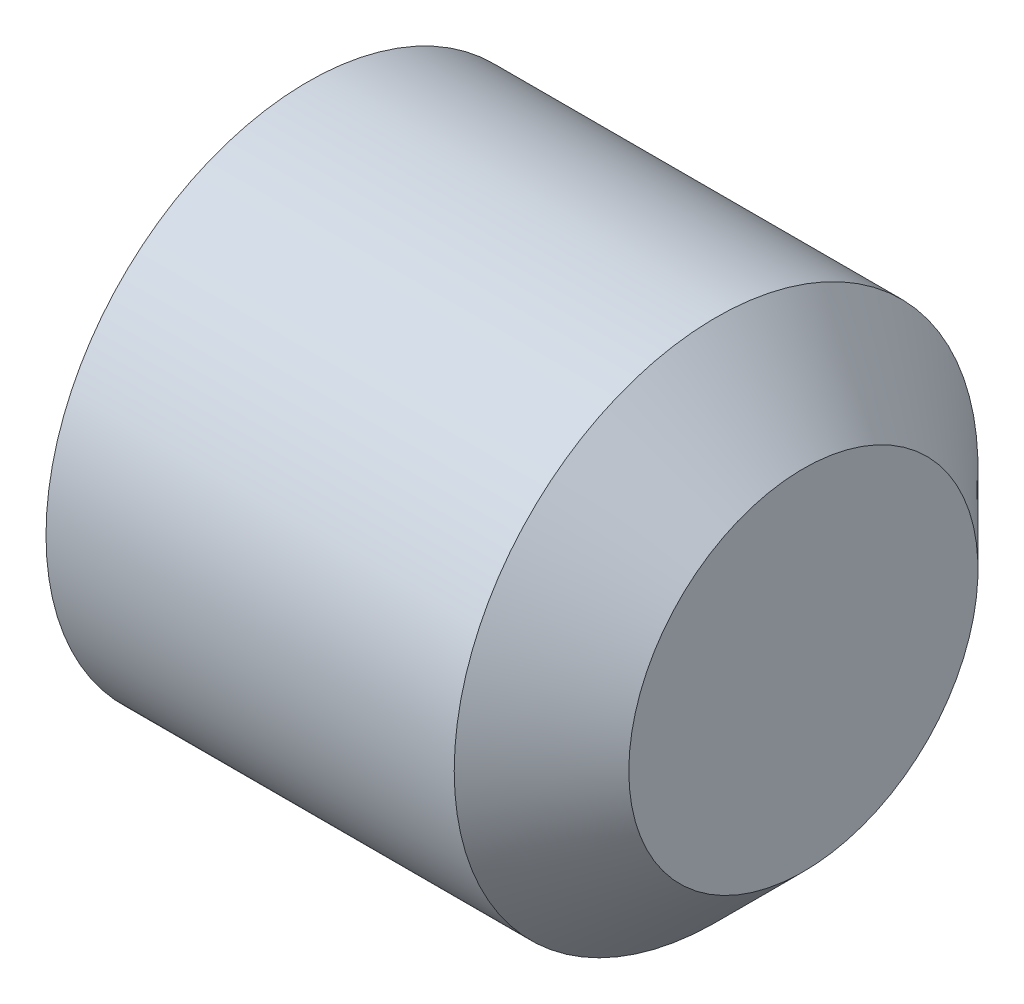
ISO-10303-21;
HEADER;
FILE_DESCRIPTION(('STEP AP214'),'2;1');
FILE_NAME('part.step','',(''),(''),'','','');
FILE_SCHEMA(('AUTOMOTIVE_DESIGN { 1 0 10303 214 1 1 1 1 }'));
ENDSEC;
DATA;
#1=APPLICATION_CONTEXT('core data for automotive mechanical design processes');
#2=APPLICATION_PROTOCOL_DEFINITION('international standard','automotive_design',2000,#1);
#3=PRODUCT_CONTEXT('',#1,'mechanical');
#4=PRODUCT('Part','Part','',(#3));
#5=PRODUCT_RELATED_PRODUCT_CATEGORY('part','',(#4));
#6=PRODUCT_DEFINITION_FORMATION('','',#4);
#7=PRODUCT_DEFINITION_CONTEXT('part definition',#1,'design');
#8=PRODUCT_DEFINITION('design','',#6,#7);
#9=PRODUCT_DEFINITION_SHAPE('','',#8);
#10=(LENGTH_UNIT() NAMED_UNIT(*) SI_UNIT(.MILLI.,.METRE.));
#11=(NAMED_UNIT(*) PLANE_ANGLE_UNIT() SI_UNIT($,.RADIAN.));
#12=(NAMED_UNIT(*) SI_UNIT($,.STERADIAN.) SOLID_ANGLE_UNIT());
#13=UNCERTAINTY_MEASURE_WITH_UNIT(LENGTH_MEASURE(1.E-05),#10,'distance_accuracy_value','');
#14=(GEOMETRIC_REPRESENTATION_CONTEXT(3) GLOBAL_UNCERTAINTY_ASSIGNED_CONTEXT((#13)) GLOBAL_UNIT_ASSIGNED_CONTEXT((#10,
#11,#12)) REPRESENTATION_CONTEXT('',''));
#15=CARTESIAN_POINT('',(0.,0.,0.));
#16=DIRECTION('',(0.,0.,1.));
#17=DIRECTION('',(1.,0.,0.));
#18=AXIS2_PLACEMENT_3D('',#15,#16,#17);
#19=CARTESIAN_POINT('',(0.,0.,0.));
#20=DIRECTION('',(-1.,0.,0.));
#21=DIRECTION('',(0.,0.,1.));
#22=AXIS2_PLACEMENT_3D('',#19,#20,#21);
#23=PLANE('',#22);
#24=CARTESIAN_POINT('',(0.,0.,0.));
#25=DIRECTION('',(-1.,0.,0.));
#26=DIRECTION('',(0.,0.,1.));
#27=AXIS2_PLACEMENT_3D('',#24,#25,#26);
#28=CIRCLE('',#27,1.2195);
#29=CARTESIAN_POINT('',(0.,0.,1.2195));
#30=VERTEX_POINT('',#29);
#31=EDGE_CURVE('E137',#30,#30,#28,.T.);
#32=ORIENTED_EDGE('',*,*,#31,.T.);
#33=EDGE_LOOP('',(#32));
#34=FACE_BOUND('',#33,.T.);
#35=DIRECTION('',(0.,0.,-1.));
#36=VECTOR('',#35,1.);
#37=CARTESIAN_POINT('',(0.,0.750000000000003,0.433012701892217));
#38=LINE('',#37,#36);
#39=CARTESIAN_POINT('',(0.,0.750000000000003,0.433012701892217));
#40=VERTEX_POINT('',#39);
#41=CARTESIAN_POINT('',(0.,0.750000000000003,-0.433012701892221));
#42=VERTEX_POINT('',#41);
#43=EDGE_CURVE('E128',#40,#42,#38,.T.);
#44=ORIENTED_EDGE('',*,*,#43,.F.);
#45=DIRECTION('',(0.,-0.866025403784439,0.5));
#46=VECTOR('',#45,1.);
#47=CARTESIAN_POINT('',(0.,0.750000000000003,0.433012701892217));
#48=LINE('',#47,#46);
#49=CARTESIAN_POINT('',(0.,0.,0.866025403784436));
#50=VERTEX_POINT('',#49);
#51=EDGE_CURVE('E50',#40,#50,#48,.T.);
#52=ORIENTED_EDGE('',*,*,#51,.T.);
#53=DIRECTION('',(0.,0.866025403784439,0.5));
#54=VECTOR('',#53,1.);
#55=CARTESIAN_POINT('',(0.,-0.749999999999997,0.433012701892217));
#56=LINE('',#55,#54);
#57=CARTESIAN_POINT('',(0.,-0.749999999999997,0.433012701892217));
#58=VERTEX_POINT('',#57);
#59=EDGE_CURVE('E119',#58,#50,#56,.T.);
#60=ORIENTED_EDGE('',*,*,#59,.F.);
#61=DIRECTION('',(0.,0.,-1.));
#62=VECTOR('',#61,1.);
#63=CARTESIAN_POINT('',(0.,-0.749999999999997,0.433012701892217));
#64=LINE('',#63,#62);
#65=CARTESIAN_POINT('',(0.,-0.749999999999997,-0.433012701892222));
#66=VERTEX_POINT('',#65);
#67=EDGE_CURVE('E122',#58,#66,#64,.T.);
#68=ORIENTED_EDGE('',*,*,#67,.T.);
#69=DIRECTION('',(0.,0.866025403784439,-0.5));
#70=VECTOR('',#69,1.);
#71=CARTESIAN_POINT('',(0.,-0.749999999999997,-0.433012701892222));
#72=LINE('',#71,#70);
#73=CARTESIAN_POINT('',(0.,0.,-0.866025403784441));
#74=VERTEX_POINT('',#73);
#75=EDGE_CURVE('E125',#66,#74,#72,.T.);
#76=ORIENTED_EDGE('',*,*,#75,.T.);
#77=DIRECTION('',(0.,-0.866025403784439,-0.5));
#78=VECTOR('',#77,1.);
#79=CARTESIAN_POINT('',(0.,0.750000000000003,-0.433012701892221));
#80=LINE('',#79,#78);
#81=EDGE_CURVE('E108',#42,#74,#80,.T.);
#82=ORIENTED_EDGE('',*,*,#81,.F.);
#83=EDGE_LOOP('',(#44,#52,#60,#68,#76,#82));
#84=FACE_BOUND('',#83,.T.);
#85=ADVANCED_FACE('F35',(#34,#84),#23,.T.);
#86=CARTESIAN_POINT('',(3.,1.,0.));
#87=DIRECTION('',(1.,0.,0.));
#88=DIRECTION('',(0.,0.,-1.));
#89=AXIS2_PLACEMENT_3D('',#86,#87,#88);
#90=PLANE('',#89);
#91=CARTESIAN_POINT('',(3.,0.,0.));
#92=DIRECTION('',(-1.,0.,0.));
#93=DIRECTION('',(0.,0.,1.));
#94=AXIS2_PLACEMENT_3D('',#91,#92,#93);
#95=CIRCLE('',#94,1.);
#96=CARTESIAN_POINT('',(3.,0.,1.));
#97=VERTEX_POINT('',#96);
#98=EDGE_CURVE('E11',#97,#97,#95,.T.);
#99=ORIENTED_EDGE('',*,*,#98,.F.);
#100=EDGE_LOOP('',(#99));
#101=FACE_BOUND('',#100,.T.);
#102=ADVANCED_FACE('F37',(#101),#90,.T.);
#103=CARTESIAN_POINT('',(2.5,0.,0.));
#104=DIRECTION('',(-1.,0.,0.));
#105=DIRECTION('',(0.,0.,1.));
#106=AXIS2_PLACEMENT_3D('',#103,#104,#105);
#107=CONICAL_SURFACE('',#106,1.5,0.785398163397448);
#108=ORIENTED_EDGE('',*,*,#98,.T.);
#109=EDGE_LOOP('',(#108));
#110=FACE_BOUND('',#109,.T.);
#111=CARTESIAN_POINT('',(2.5,0.,0.));
#112=DIRECTION('',(-1.,0.,0.));
#113=DIRECTION('',(0.,0.,1.));
#114=AXIS2_PLACEMENT_3D('',#111,#112,#113);
#115=CIRCLE('',#114,1.5);
#116=CARTESIAN_POINT('',(2.5,0.,1.5));
#117=VERTEX_POINT('',#116);
#118=EDGE_CURVE('E43',#117,#117,#115,.T.);
#119=ORIENTED_EDGE('',*,*,#118,.F.);
#120=EDGE_LOOP('',(#119));
#121=FACE_BOUND('',#120,.T.);
#122=ADVANCED_FACE('F148',(#110,#121),#107,.T.);
#123=CARTESIAN_POINT('',(-12.7,0.,0.));
#124=DIRECTION('',(-1.,0.,0.));
#125=DIRECTION('',(0.,0.,1.));
#126=AXIS2_PLACEMENT_3D('',#123,#124,#125);
#127=CYLINDRICAL_SURFACE('',#126,1.5);
#128=ORIENTED_EDGE('',*,*,#118,.T.);
#129=EDGE_LOOP('',(#128));
#130=FACE_BOUND('',#129,.T.);
#131=CARTESIAN_POINT('',(0.161946750507689,0.,0.));
#132=DIRECTION('',(-1.,0.,0.));
#133=DIRECTION('',(0.,0.,1.));
#134=AXIS2_PLACEMENT_3D('',#131,#132,#133);
#135=CIRCLE('',#134,1.5);
#136=CARTESIAN_POINT('',(0.161946750507689,0.,1.5));
#137=VERTEX_POINT('',#136);
#138=EDGE_CURVE('E140',#137,#137,#135,.T.);
#139=ORIENTED_EDGE('',*,*,#138,.F.);
#140=EDGE_LOOP('',(#139));
#141=FACE_BOUND('',#140,.T.);
#142=ADVANCED_FACE('F145',(#130,#141),#127,.T.);
#143=CARTESIAN_POINT('',(0.,0.,0.));
#144=DIRECTION('',(1.,0.,0.));
#145=DIRECTION('',(0.,0.,-1.));
#146=AXIS2_PLACEMENT_3D('',#143,#144,#145);
#147=CONICAL_SURFACE('',#146,1.2195,1.0471975511966);
#148=ORIENTED_EDGE('',*,*,#138,.T.);
#149=EDGE_LOOP('',(#148));
#150=FACE_BOUND('',#149,.T.);
#151=ORIENTED_EDGE('',*,*,#31,.F.);
#152=EDGE_LOOP('',(#151));
#153=FACE_BOUND('',#152,.T.);
#154=ADVANCED_FACE('F155',(#150,#153),#147,.T.);
#155=CARTESIAN_POINT('',(1.2,0.750000000000003,0.433012701892217));
#156=DIRECTION('',(0.,-0.5,-0.866025403784439));
#157=DIRECTION('',(0.,0.866025403784439,-0.5));
#158=AXIS2_PLACEMENT_3D('',#155,#156,#157);
#159=PLANE('',#158);
#160=ORIENTED_EDGE('',*,*,#51,.F.);
#161=DIRECTION('',(-1.,0.,0.));
#162=VECTOR('',#161,1.);
#163=CARTESIAN_POINT('',(1.2,0.750000000000003,0.433012701892217));
#164=LINE('',#163,#162);
#165=CARTESIAN_POINT('',(1.2,0.750000000000003,0.433012701892217));
#166=VERTEX_POINT('',#165);
#167=EDGE_CURVE('E55',#166,#40,#164,.T.);
#168=ORIENTED_EDGE('',*,*,#167,.F.);
#169=DIRECTION('',(0.,-0.866025403784439,0.5));
#170=VECTOR('',#169,1.);
#171=CARTESIAN_POINT('',(1.2,0.750000000000003,0.433012701892217));
#172=LINE('',#171,#170);
#173=CARTESIAN_POINT('',(1.2,0.,0.866025403784436));
#174=VERTEX_POINT('',#173);
#175=EDGE_CURVE('E82',#166,#174,#172,.T.);
#176=ORIENTED_EDGE('',*,*,#175,.T.);
#177=DIRECTION('',(-1.,0.,0.));
#178=VECTOR('',#177,1.);
#179=CARTESIAN_POINT('',(1.2,0.,0.866025403784436));
#180=LINE('',#179,#178);
#181=EDGE_CURVE('E135',#174,#50,#180,.T.);
#182=ORIENTED_EDGE('',*,*,#181,.T.);
#183=EDGE_LOOP('',(#160,#168,#176,#182));
#184=FACE_BOUND('',#183,.T.);
#185=ADVANCED_FACE('F166',(#184),#159,.T.);
#186=CARTESIAN_POINT('',(1.2,-0.749999999999997,0.433012701892217));
#187=DIRECTION('',(0.,-0.5,0.866025403784439));
#188=DIRECTION('',(0.,-0.866025403784439,-0.5));
#189=AXIS2_PLACEMENT_3D('',#186,#187,#188);
#190=PLANE('',#189);
#191=ORIENTED_EDGE('',*,*,#59,.T.);
#192=ORIENTED_EDGE('',*,*,#181,.F.);
#193=DIRECTION('',(0.,0.866025403784439,0.5));
#194=VECTOR('',#193,1.);
#195=CARTESIAN_POINT('',(1.2,-0.749999999999997,0.433012701892217));
#196=LINE('',#195,#194);
#197=CARTESIAN_POINT('',(1.2,-0.749999999999997,0.433012701892217));
#198=VERTEX_POINT('',#197);
#199=EDGE_CURVE('E266',#198,#174,#196,.T.);
#200=ORIENTED_EDGE('',*,*,#199,.F.);
#201=DIRECTION('',(-1.,0.,0.));
#202=VECTOR('',#201,1.);
#203=CARTESIAN_POINT('',(1.2,-0.749999999999997,0.433012701892217));
#204=LINE('',#203,#202);
#205=EDGE_CURVE('E133',#198,#58,#204,.T.);
#206=ORIENTED_EDGE('',*,*,#205,.T.);
#207=EDGE_LOOP('',(#191,#192,#200,#206));
#208=FACE_BOUND('',#207,.T.);
#209=ADVANCED_FACE('F173',(#208),#190,.F.);
#210=CARTESIAN_POINT('',(1.2,-0.749999999999997,0.433012701892217));
#211=DIRECTION('',(0.,1.,0.));
#212=DIRECTION('',(0.,0.,1.));
#213=AXIS2_PLACEMENT_3D('',#210,#211,#212);
#214=PLANE('',#213);
#215=ORIENTED_EDGE('',*,*,#67,.F.);
#216=ORIENTED_EDGE('',*,*,#205,.F.);
#217=DIRECTION('',(0.,0.,-1.));
#218=VECTOR('',#217,1.);
#219=CARTESIAN_POINT('',(1.2,-0.749999999999997,0.433012701892217));
#220=LINE('',#219,#218);
#221=CARTESIAN_POINT('',(1.2,-0.749999999999997,-0.433012701892222));
#222=VERTEX_POINT('',#221);
#223=EDGE_CURVE('E103',#198,#222,#220,.T.);
#224=ORIENTED_EDGE('',*,*,#223,.T.);
#225=DIRECTION('',(-1.,0.,0.));
#226=VECTOR('',#225,1.);
#227=CARTESIAN_POINT('',(1.2,-0.749999999999997,-0.433012701892222));
#228=LINE('',#227,#226);
#229=EDGE_CURVE('E98',#222,#66,#228,.T.);
#230=ORIENTED_EDGE('',*,*,#229,.T.);
#231=EDGE_LOOP('',(#215,#216,#224,#230));
#232=FACE_BOUND('',#231,.T.);
#233=ADVANCED_FACE('F180',(#232),#214,.T.);
#234=CARTESIAN_POINT('',(1.2,-0.749999999999997,-0.433012701892222));
#235=DIRECTION('',(0.,0.5,0.866025403784439));
#236=DIRECTION('',(0.,-0.866025403784439,0.5));
#237=AXIS2_PLACEMENT_3D('',#234,#235,#236);
#238=PLANE('',#237);
#239=ORIENTED_EDGE('',*,*,#75,.F.);
#240=ORIENTED_EDGE('',*,*,#229,.F.);
#241=DIRECTION('',(0.,0.866025403784439,-0.5));
#242=VECTOR('',#241,1.);
#243=CARTESIAN_POINT('',(1.2,-0.749999999999997,-0.433012701892222));
#244=LINE('',#243,#242);
#245=CARTESIAN_POINT('',(1.2,0.,-0.866025403784441));
#246=VERTEX_POINT('',#245);
#247=EDGE_CURVE('E93',#222,#246,#244,.T.);
#248=ORIENTED_EDGE('',*,*,#247,.T.);
#249=DIRECTION('',(-1.,0.,0.));
#250=VECTOR('',#249,1.);
#251=CARTESIAN_POINT('',(1.2,0.,-0.866025403784441));
#252=LINE('',#251,#250);
#253=EDGE_CURVE('E97',#246,#74,#252,.T.);
#254=ORIENTED_EDGE('',*,*,#253,.T.);
#255=EDGE_LOOP('',(#239,#240,#248,#254));
#256=FACE_BOUND('',#255,.T.);
#257=ADVANCED_FACE('F96',(#256),#238,.T.);
#258=CARTESIAN_POINT('',(1.2,0.750000000000003,-0.433012701892221));
#259=DIRECTION('',(0.,0.5,-0.866025403784439));
#260=DIRECTION('',(0.,0.866025403784439,0.5));
#261=AXIS2_PLACEMENT_3D('',#258,#259,#260);
#262=PLANE('',#261);
#263=ORIENTED_EDGE('',*,*,#81,.T.);
#264=ORIENTED_EDGE('',*,*,#253,.F.);
#265=DIRECTION('',(0.,-0.866025403784439,-0.5));
#266=VECTOR('',#265,1.);
#267=CARTESIAN_POINT('',(1.2,0.750000000000003,-0.433012701892221));
#268=LINE('',#267,#266);
#269=CARTESIAN_POINT('',(1.2,0.750000000000003,-0.433012701892221));
#270=VERTEX_POINT('',#269);
#271=EDGE_CURVE('E102',#270,#246,#268,.T.);
#272=ORIENTED_EDGE('',*,*,#271,.F.);
#273=DIRECTION('',(-1.,0.,0.));
#274=VECTOR('',#273,1.);
#275=CARTESIAN_POINT('',(1.2,0.750000000000003,-0.433012701892221));
#276=LINE('',#275,#274);
#277=EDGE_CURVE('E78',#270,#42,#276,.T.);
#278=ORIENTED_EDGE('',*,*,#277,.T.);
#279=EDGE_LOOP('',(#263,#264,#272,#278));
#280=FACE_BOUND('',#279,.T.);
#281=ADVANCED_FACE('F105',(#280),#262,.F.);
#282=CARTESIAN_POINT('',(1.2,0.750000000000003,0.433012701892217));
#283=DIRECTION('',(0.,1.,0.));
#284=DIRECTION('',(0.,0.,1.));
#285=AXIS2_PLACEMENT_3D('',#282,#283,#284);
#286=PLANE('',#285);
#287=ORIENTED_EDGE('',*,*,#43,.T.);
#288=ORIENTED_EDGE('',*,*,#277,.F.);
#289=DIRECTION('',(0.,0.,-1.));
#290=VECTOR('',#289,1.);
#291=CARTESIAN_POINT('',(1.2,0.750000000000003,0.433012701892217));
#292=LINE('',#291,#290);
#293=EDGE_CURVE('E113',#166,#270,#292,.T.);
#294=ORIENTED_EDGE('',*,*,#293,.F.);
#295=ORIENTED_EDGE('',*,*,#167,.T.);
#296=EDGE_LOOP('',(#287,#288,#294,#295));
#297=FACE_BOUND('',#296,.T.);
#298=ADVANCED_FACE('F192',(#297),#286,.F.);
#299=CARTESIAN_POINT('',(1.2,0.750000000000003,0.433012701892217));
#300=DIRECTION('',(1.,0.,0.));
#301=DIRECTION('',(0.,0.,-1.));
#302=AXIS2_PLACEMENT_3D('',#299,#300,#301);
#303=PLANE('',#302);
#304=ORIENTED_EDGE('',*,*,#175,.F.);
#305=ORIENTED_EDGE('',*,*,#293,.T.);
#306=ORIENTED_EDGE('',*,*,#271,.T.);
#307=ORIENTED_EDGE('',*,*,#247,.F.);
#308=ORIENTED_EDGE('',*,*,#223,.F.);
#309=ORIENTED_EDGE('',*,*,#199,.T.);
#310=EDGE_LOOP('',(#304,#305,#306,#307,#308,#309));
#311=FACE_BOUND('',#310,.T.);
#312=ADVANCED_FACE('F111',(#311),#303,.F.);
#313=CLOSED_SHELL('',(#85,#102,#122,#142,#154,#185,#209,#233,#257,#281,#298,#312));
#314=MANIFOLD_SOLID_BREP('B2',#313);
#315=ADVANCED_BREP_SHAPE_REPRESENTATION('',(#18,#314),#14);
#316=SHAPE_DEFINITION_REPRESENTATION(#9,#315);
ENDSEC;
END-ISO-10303-21;
